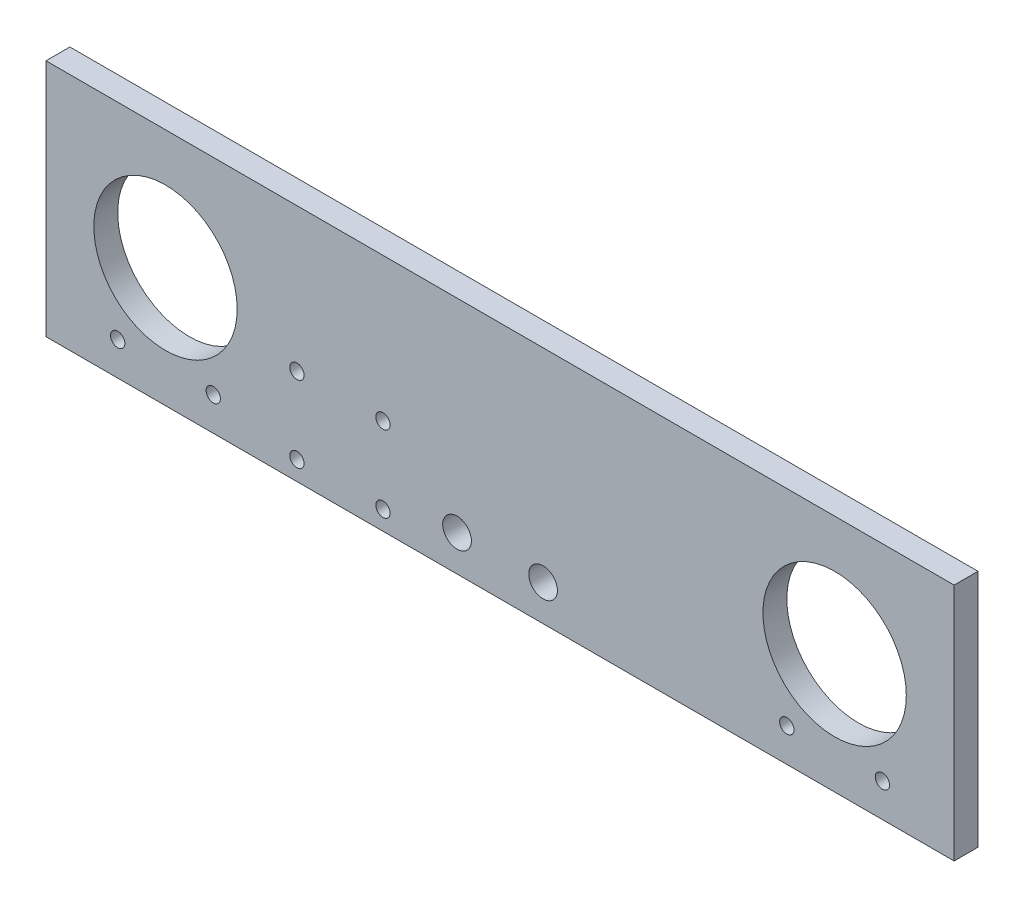
ISO-10303-21;
HEADER;
FILE_DESCRIPTION(('STEP AP214'),'2;1');
FILE_NAME('part.step','',(''),(''),'','','');
FILE_SCHEMA(('AUTOMOTIVE_DESIGN { 1 0 10303 214 1 1 1 1 }'));
ENDSEC;
DATA;
#1=APPLICATION_CONTEXT('core data for automotive mechanical design processes');
#2=APPLICATION_PROTOCOL_DEFINITION('international standard','automotive_design',2000,#1);
#3=PRODUCT_CONTEXT('',#1,'mechanical');
#4=PRODUCT('Part','Part','',(#3));
#5=PRODUCT_RELATED_PRODUCT_CATEGORY('part','',(#4));
#6=PRODUCT_DEFINITION_FORMATION('','',#4);
#7=PRODUCT_DEFINITION_CONTEXT('part definition',#1,'design');
#8=PRODUCT_DEFINITION('design','',#6,#7);
#9=PRODUCT_DEFINITION_SHAPE('','',#8);
#10=(LENGTH_UNIT() NAMED_UNIT(*) SI_UNIT(.MILLI.,.METRE.));
#11=(NAMED_UNIT(*) PLANE_ANGLE_UNIT() SI_UNIT($,.RADIAN.));
#12=(NAMED_UNIT(*) SI_UNIT($,.STERADIAN.) SOLID_ANGLE_UNIT());
#13=UNCERTAINTY_MEASURE_WITH_UNIT(LENGTH_MEASURE(1.E-05),#10,'distance_accuracy_value','');
#14=(GEOMETRIC_REPRESENTATION_CONTEXT(3) GLOBAL_UNCERTAINTY_ASSIGNED_CONTEXT((#13)) GLOBAL_UNIT_ASSIGNED_CONTEXT((#10,
#11,#12)) REPRESENTATION_CONTEXT('',''));
#15=CARTESIAN_POINT('',(0.,0.,0.));
#16=DIRECTION('',(0.,0.,1.));
#17=DIRECTION('',(1.,0.,0.));
#18=AXIS2_PLACEMENT_3D('',#15,#16,#17);
#19=CARTESIAN_POINT('',(0.,0.,0.));
#20=DIRECTION('',(0.,0.,1.));
#21=DIRECTION('',(1.,0.,0.));
#22=AXIS2_PLACEMENT_3D('',#19,#20,#21);
#23=PLANE('',#22);
#24=CARTESIAN_POINT('',(155.,7.,0.));
#25=DIRECTION('',(0.,0.,1.));
#26=DIRECTION('',(1.,0.,0.));
#27=AXIS2_PLACEMENT_3D('',#24,#25,#26);
#28=CIRCLE('',#27,2.75000000000001);
#29=CARTESIAN_POINT('',(157.75,7.,0.));
#30=VERTEX_POINT('',#29);
#31=EDGE_CURVE('E154',#30,#30,#28,.T.);
#32=ORIENTED_EDGE('',*,*,#31,.T.);
#33=EDGE_LOOP('',(#32));
#34=FACE_BOUND('',#33,.T.);
#35=CARTESIAN_POINT('',(15.,7.,0.));
#36=DIRECTION('',(0.,0.,1.));
#37=DIRECTION('',(1.,0.,0.));
#38=AXIS2_PLACEMENT_3D('',#35,#36,#37);
#39=CIRCLE('',#38,2.75);
#40=CARTESIAN_POINT('',(17.75,7.,0.));
#41=VERTEX_POINT('',#40);
#42=EDGE_CURVE('E143',#41,#41,#39,.T.);
#43=ORIENTED_EDGE('',*,*,#42,.T.);
#44=EDGE_LOOP('',(#43));
#45=FACE_BOUND('',#44,.T.);
#46=CARTESIAN_POINT('',(70.5,4.,0.));
#47=DIRECTION('',(0.,0.,1.));
#48=DIRECTION('',(1.,0.,0.));
#49=AXIS2_PLACEMENT_3D('',#46,#47,#48);
#50=CIRCLE('',#49,1.5);
#51=CARTESIAN_POINT('',(72.,4.,0.));
#52=VERTEX_POINT('',#51);
#53=EDGE_CURVE('E102',#52,#52,#50,.T.);
#54=ORIENTED_EDGE('',*,*,#53,.T.);
#55=EDGE_LOOP('',(#54));
#56=FACE_BOUND('',#55,.T.);
#57=CARTESIAN_POINT('',(52.5,20.,0.));
#58=DIRECTION('',(0.,0.,1.));
#59=DIRECTION('',(1.,0.,0.));
#60=AXIS2_PLACEMENT_3D('',#57,#58,#59);
#61=CIRCLE('',#60,1.5);
#62=CARTESIAN_POINT('',(54.,20.,0.));
#63=VERTEX_POINT('',#62);
#64=EDGE_CURVE('E105',#63,#63,#61,.T.);
#65=ORIENTED_EDGE('',*,*,#64,.T.);
#66=EDGE_LOOP('',(#65));
#67=FACE_BOUND('',#66,.T.);
#68=CARTESIAN_POINT('',(52.5,4.,0.));
#69=DIRECTION('',(0.,0.,1.));
#70=DIRECTION('',(1.,0.,0.));
#71=AXIS2_PLACEMENT_3D('',#68,#69,#70);
#72=CIRCLE('',#71,1.5);
#73=CARTESIAN_POINT('',(54.,4.,0.));
#74=VERTEX_POINT('',#73);
#75=EDGE_CURVE('E109',#74,#74,#72,.T.);
#76=ORIENTED_EDGE('',*,*,#75,.T.);
#77=EDGE_LOOP('',(#76));
#78=FACE_BOUND('',#77,.T.);
#79=CARTESIAN_POINT('',(104.,7.5,0.));
#80=DIRECTION('',(0.,0.,1.));
#81=DIRECTION('',(1.,0.,0.));
#82=AXIS2_PLACEMENT_3D('',#79,#80,#81);
#83=CIRCLE('',#82,3.00000000000001);
#84=CARTESIAN_POINT('',(107.,7.5,0.));
#85=VERTEX_POINT('',#84);
#86=EDGE_CURVE('E112',#85,#85,#83,.T.);
#87=ORIENTED_EDGE('',*,*,#86,.T.);
#88=EDGE_LOOP('',(#87));
#89=FACE_BOUND('',#88,.T.);
#90=CARTESIAN_POINT('',(86.,7.5,0.));
#91=DIRECTION('',(0.,0.,1.));
#92=DIRECTION('',(1.,0.,0.));
#93=AXIS2_PLACEMENT_3D('',#90,#91,#92);
#94=CIRCLE('',#93,3.00000000000001);
#95=CARTESIAN_POINT('',(89.,7.5,0.));
#96=VERTEX_POINT('',#95);
#97=EDGE_CURVE('E115',#96,#96,#94,.T.);
#98=ORIENTED_EDGE('',*,*,#97,.T.);
#99=EDGE_LOOP('',(#98));
#100=FACE_BOUND('',#99,.T.);
#101=CARTESIAN_POINT('',(70.5,20.,0.));
#102=DIRECTION('',(0.,0.,1.));
#103=DIRECTION('',(1.,0.,0.));
#104=AXIS2_PLACEMENT_3D('',#101,#102,#103);
#105=CIRCLE('',#104,1.5);
#106=CARTESIAN_POINT('',(72.,20.,0.));
#107=VERTEX_POINT('',#106);
#108=EDGE_CURVE('E118',#107,#107,#105,.T.);
#109=ORIENTED_EDGE('',*,*,#108,.T.);
#110=EDGE_LOOP('',(#109));
#111=FACE_BOUND('',#110,.T.);
#112=CARTESIAN_POINT('',(165.,25.,0.));
#113=DIRECTION('',(0.,0.,1.));
#114=DIRECTION('',(1.,0.,0.));
#115=AXIS2_PLACEMENT_3D('',#112,#113,#114);
#116=CIRCLE('',#115,15.);
#117=CARTESIAN_POINT('',(180.,25.,0.));
#118=VERTEX_POINT('',#117);
#119=EDGE_CURVE('E121',#118,#118,#116,.T.);
#120=ORIENTED_EDGE('',*,*,#119,.T.);
#121=EDGE_LOOP('',(#120));
#122=FACE_BOUND('',#121,.T.);
#123=CARTESIAN_POINT('',(25.,25.,0.));
#124=DIRECTION('',(0.,0.,1.));
#125=DIRECTION('',(1.,0.,0.));
#126=AXIS2_PLACEMENT_3D('',#123,#124,#125);
#127=CIRCLE('',#126,15.);
#128=CARTESIAN_POINT('',(40.,25.,0.));
#129=VERTEX_POINT('',#128);
#130=EDGE_CURVE('E124',#129,#129,#127,.T.);
#131=ORIENTED_EDGE('',*,*,#130,.T.);
#132=EDGE_LOOP('',(#131));
#133=FACE_BOUND('',#132,.T.);
#134=DIRECTION('',(1.,0.,0.));
#135=VECTOR('',#134,1.);
#136=CARTESIAN_POINT('',(0.,0.,0.));
#137=LINE('',#136,#135);
#138=CARTESIAN_POINT('',(0.,0.,0.));
#139=VERTEX_POINT('',#138);
#140=CARTESIAN_POINT('',(190.,0.,0.));
#141=VERTEX_POINT('',#140);
#142=EDGE_CURVE('E127',#139,#141,#137,.T.);
#143=ORIENTED_EDGE('',*,*,#142,.F.);
#144=DIRECTION('',(0.,1.,0.));
#145=VECTOR('',#144,1.);
#146=CARTESIAN_POINT('',(0.,0.,0.));
#147=LINE('',#146,#145);
#148=CARTESIAN_POINT('',(0.,50.,0.));
#149=VERTEX_POINT('',#148);
#150=EDGE_CURVE('E132',#139,#149,#147,.T.);
#151=ORIENTED_EDGE('',*,*,#150,.T.);
#152=DIRECTION('',(1.,0.,0.));
#153=VECTOR('',#152,1.);
#154=CARTESIAN_POINT('',(0.,50.,0.));
#155=LINE('',#154,#153);
#156=CARTESIAN_POINT('',(190.,50.,0.));
#157=VERTEX_POINT('',#156);
#158=EDGE_CURVE('E130',#149,#157,#155,.T.);
#159=ORIENTED_EDGE('',*,*,#158,.T.);
#160=DIRECTION('',(0.,1.,0.));
#161=VECTOR('',#160,1.);
#162=CARTESIAN_POINT('',(190.,0.,0.));
#163=LINE('',#162,#161);
#164=EDGE_CURVE('E92',#141,#157,#163,.T.);
#165=ORIENTED_EDGE('',*,*,#164,.F.);
#166=EDGE_LOOP('',(#143,#151,#159,#165));
#167=FACE_BOUND('',#166,.T.);
#168=CARTESIAN_POINT('',(35.,7.,0.));
#169=DIRECTION('',(0.,0.,1.));
#170=DIRECTION('',(1.,0.,0.));
#171=AXIS2_PLACEMENT_3D('',#168,#169,#170);
#172=CIRCLE('',#171,2.75);
#173=CARTESIAN_POINT('',(37.75,7.,0.));
#174=VERTEX_POINT('',#173);
#175=EDGE_CURVE('E147',#174,#174,#172,.T.);
#176=ORIENTED_EDGE('',*,*,#175,.T.);
#177=EDGE_LOOP('',(#176));
#178=FACE_BOUND('',#177,.T.);
#179=CARTESIAN_POINT('',(175.,7.,0.));
#180=DIRECTION('',(0.,0.,1.));
#181=DIRECTION('',(1.,0.,0.));
#182=AXIS2_PLACEMENT_3D('',#179,#180,#181);
#183=CIRCLE('',#182,2.75000000000001);
#184=CARTESIAN_POINT('',(177.75,7.,0.));
#185=VERTEX_POINT('',#184);
#186=EDGE_CURVE('E161',#185,#185,#183,.T.);
#187=ORIENTED_EDGE('',*,*,#186,.T.);
#188=EDGE_LOOP('',(#187));
#189=FACE_BOUND('',#188,.T.);
#190=ADVANCED_FACE('F35',(#34,#45,#56,#67,#78,#89,#100,#111,#122,#133,#167,#178,#189),#23,.F.);
#191=CARTESIAN_POINT('',(0.,0.,5.));
#192=DIRECTION('',(0.,1.,0.));
#193=DIRECTION('',(0.,0.,1.));
#194=AXIS2_PLACEMENT_3D('',#191,#192,#193);
#195=PLANE('',#194);
#196=ORIENTED_EDGE('',*,*,#142,.T.);
#197=DIRECTION('',(0.,0.,-1.));
#198=VECTOR('',#197,1.);
#199=CARTESIAN_POINT('',(190.,0.,5.));
#200=LINE('',#199,#198);
#201=CARTESIAN_POINT('',(190.,0.,5.));
#202=VERTEX_POINT('',#201);
#203=EDGE_CURVE('E11',#202,#141,#200,.T.);
#204=ORIENTED_EDGE('',*,*,#203,.F.);
#205=DIRECTION('',(1.,0.,0.));
#206=VECTOR('',#205,1.);
#207=CARTESIAN_POINT('',(0.,0.,5.));
#208=LINE('',#207,#206);
#209=CARTESIAN_POINT('',(0.,0.,5.));
#210=VERTEX_POINT('',#209);
#211=EDGE_CURVE('E87',#210,#202,#208,.T.);
#212=ORIENTED_EDGE('',*,*,#211,.F.);
#213=DIRECTION('',(0.,0.,-1.));
#214=VECTOR('',#213,1.);
#215=CARTESIAN_POINT('',(0.,0.,5.));
#216=LINE('',#215,#214);
#217=EDGE_CURVE('E54',#210,#139,#216,.T.);
#218=ORIENTED_EDGE('',*,*,#217,.T.);
#219=EDGE_LOOP('',(#196,#204,#212,#218));
#220=FACE_BOUND('',#219,.T.);
#221=ADVANCED_FACE('F226',(#220),#195,.F.);
#222=CARTESIAN_POINT('',(190.,0.,5.));
#223=DIRECTION('',(-1.,0.,0.));
#224=DIRECTION('',(0.,0.,1.));
#225=AXIS2_PLACEMENT_3D('',#222,#223,#224);
#226=PLANE('',#225);
#227=ORIENTED_EDGE('',*,*,#164,.T.);
#228=DIRECTION('',(0.,0.,-1.));
#229=VECTOR('',#228,1.);
#230=CARTESIAN_POINT('',(190.,50.,5.));
#231=LINE('',#230,#229);
#232=CARTESIAN_POINT('',(190.,50.,5.));
#233=VERTEX_POINT('',#232);
#234=EDGE_CURVE('E45',#233,#157,#231,.T.);
#235=ORIENTED_EDGE('',*,*,#234,.F.);
#236=DIRECTION('',(0.,1.,0.));
#237=VECTOR('',#236,1.);
#238=CARTESIAN_POINT('',(190.,0.,5.));
#239=LINE('',#238,#237);
#240=EDGE_CURVE('E79',#202,#233,#239,.T.);
#241=ORIENTED_EDGE('',*,*,#240,.F.);
#242=ORIENTED_EDGE('',*,*,#203,.T.);
#243=EDGE_LOOP('',(#227,#235,#241,#242));
#244=FACE_BOUND('',#243,.T.);
#245=ADVANCED_FACE('F91',(#244),#226,.F.);
#246=CARTESIAN_POINT('',(0.,50.,5.));
#247=DIRECTION('',(0.,1.,0.));
#248=DIRECTION('',(-1.,0.,0.));
#249=AXIS2_PLACEMENT_3D('',#246,#247,#248);
#250=PLANE('',#249);
#251=ORIENTED_EDGE('',*,*,#158,.F.);
#252=DIRECTION('',(0.,0.,-1.));
#253=VECTOR('',#252,1.);
#254=CARTESIAN_POINT('',(0.,50.,5.));
#255=LINE('',#254,#253);
#256=CARTESIAN_POINT('',(0.,50.,5.));
#257=VERTEX_POINT('',#256);
#258=EDGE_CURVE('E68',#257,#149,#255,.T.);
#259=ORIENTED_EDGE('',*,*,#258,.F.);
#260=DIRECTION('',(1.,0.,0.));
#261=VECTOR('',#260,1.);
#262=CARTESIAN_POINT('',(0.,50.,5.));
#263=LINE('',#262,#261);
#264=EDGE_CURVE('E86',#257,#233,#263,.T.);
#265=ORIENTED_EDGE('',*,*,#264,.T.);
#266=ORIENTED_EDGE('',*,*,#234,.T.);
#267=EDGE_LOOP('',(#251,#259,#265,#266));
#268=FACE_BOUND('',#267,.T.);
#269=ADVANCED_FACE('F96',(#268),#250,.T.);
#270=CARTESIAN_POINT('',(25.,25.,5.));
#271=DIRECTION('',(0.,0.,-1.));
#272=DIRECTION('',(-1.,0.,0.));
#273=AXIS2_PLACEMENT_3D('',#270,#271,#272);
#274=CYLINDRICAL_SURFACE('',#273,15.);
#275=CARTESIAN_POINT('',(25.,25.,5.));
#276=DIRECTION('',(0.,0.,1.));
#277=DIRECTION('',(1.,0.,0.));
#278=AXIS2_PLACEMENT_3D('',#275,#276,#277);
#279=CIRCLE('',#278,15.);
#280=CARTESIAN_POINT('',(40.,25.,5.));
#281=VERTEX_POINT('',#280);
#282=EDGE_CURVE('E202',#281,#281,#279,.T.);
#283=ORIENTED_EDGE('',*,*,#282,.T.);
#284=EDGE_LOOP('',(#283));
#285=FACE_BOUND('',#284,.T.);
#286=ORIENTED_EDGE('',*,*,#130,.F.);
#287=EDGE_LOOP('',(#286));
#288=FACE_BOUND('',#287,.T.);
#289=ADVANCED_FACE('F206',(#285,#288),#274,.F.);
#290=CARTESIAN_POINT('',(165.,25.,5.));
#291=DIRECTION('',(0.,0.,-1.));
#292=DIRECTION('',(-1.,0.,0.));
#293=AXIS2_PLACEMENT_3D('',#290,#291,#292);
#294=CYLINDRICAL_SURFACE('',#293,15.);
#295=CARTESIAN_POINT('',(165.,25.,5.));
#296=DIRECTION('',(0.,0.,1.));
#297=DIRECTION('',(1.,0.,0.));
#298=AXIS2_PLACEMENT_3D('',#295,#296,#297);
#299=CIRCLE('',#298,15.);
#300=CARTESIAN_POINT('',(180.,25.,5.));
#301=VERTEX_POINT('',#300);
#302=EDGE_CURVE('E199',#301,#301,#299,.T.);
#303=ORIENTED_EDGE('',*,*,#302,.T.);
#304=EDGE_LOOP('',(#303));
#305=FACE_BOUND('',#304,.T.);
#306=ORIENTED_EDGE('',*,*,#119,.F.);
#307=EDGE_LOOP('',(#306));
#308=FACE_BOUND('',#307,.T.);
#309=ADVANCED_FACE('F240',(#305,#308),#294,.F.);
#310=CARTESIAN_POINT('',(35.,7.,5.));
#311=DIRECTION('',(0.,0.,-1.));
#312=DIRECTION('',(-1.,0.,0.));
#313=AXIS2_PLACEMENT_3D('',#310,#311,#312);
#314=CYLINDRICAL_SURFACE('',#313,1.5);
#315=CARTESIAN_POINT('',(35.,7.,1.5));
#316=DIRECTION('',(0.,0.,1.));
#317=DIRECTION('',(1.,0.,0.));
#318=AXIS2_PLACEMENT_3D('',#315,#316,#317);
#319=CIRCLE('',#318,1.5);
#320=CARTESIAN_POINT('',(36.5,7.,1.5));
#321=VERTEX_POINT('',#320);
#322=EDGE_CURVE('E141',#321,#321,#319,.T.);
#323=ORIENTED_EDGE('',*,*,#322,.F.);
#324=EDGE_LOOP('',(#323));
#325=FACE_BOUND('',#324,.T.);
#326=CARTESIAN_POINT('',(35.,7.,5.));
#327=DIRECTION('',(0.,0.,1.));
#328=DIRECTION('',(1.,0.,0.));
#329=AXIS2_PLACEMENT_3D('',#326,#327,#328);
#330=CIRCLE('',#329,1.5);
#331=CARTESIAN_POINT('',(36.5,7.,5.));
#332=VERTEX_POINT('',#331);
#333=EDGE_CURVE('E196',#332,#332,#330,.T.);
#334=ORIENTED_EDGE('',*,*,#333,.T.);
#335=EDGE_LOOP('',(#334));
#336=FACE_BOUND('',#335,.T.);
#337=ADVANCED_FACE('F243',(#325,#336),#314,.F.);
#338=CARTESIAN_POINT('',(175.,7.,5.));
#339=DIRECTION('',(0.,0.,-1.));
#340=DIRECTION('',(-1.,0.,0.));
#341=AXIS2_PLACEMENT_3D('',#338,#339,#340);
#342=CYLINDRICAL_SURFACE('',#341,1.5);
#343=CARTESIAN_POINT('',(175.,7.,1.5));
#344=DIRECTION('',(0.,0.,1.));
#345=DIRECTION('',(1.,0.,0.));
#346=AXIS2_PLACEMENT_3D('',#343,#344,#345);
#347=CIRCLE('',#346,1.5);
#348=CARTESIAN_POINT('',(176.5,7.,1.5));
#349=VERTEX_POINT('',#348);
#350=EDGE_CURVE('E39',#349,#349,#347,.T.);
#351=ORIENTED_EDGE('',*,*,#350,.F.);
#352=EDGE_LOOP('',(#351));
#353=FACE_BOUND('',#352,.T.);
#354=CARTESIAN_POINT('',(175.,7.,5.));
#355=DIRECTION('',(0.,0.,1.));
#356=DIRECTION('',(1.,0.,0.));
#357=AXIS2_PLACEMENT_3D('',#354,#355,#356);
#358=CIRCLE('',#357,1.5);
#359=CARTESIAN_POINT('',(176.5,7.,5.));
#360=VERTEX_POINT('',#359);
#361=EDGE_CURVE('E193',#360,#360,#358,.T.);
#362=ORIENTED_EDGE('',*,*,#361,.T.);
#363=EDGE_LOOP('',(#362));
#364=FACE_BOUND('',#363,.T.);
#365=ADVANCED_FACE('F247',(#353,#364),#342,.F.);
#366=CARTESIAN_POINT('',(155.,7.,5.));
#367=DIRECTION('',(0.,0.,-1.));
#368=DIRECTION('',(-1.,0.,0.));
#369=AXIS2_PLACEMENT_3D('',#366,#367,#368);
#370=CYLINDRICAL_SURFACE('',#369,1.5);
#371=CARTESIAN_POINT('',(155.,7.,1.5));
#372=DIRECTION('',(0.,0.,1.));
#373=DIRECTION('',(1.,0.,0.));
#374=AXIS2_PLACEMENT_3D('',#371,#372,#373);
#375=CIRCLE('',#374,1.5);
#376=CARTESIAN_POINT('',(156.5,7.,1.5));
#377=VERTEX_POINT('',#376);
#378=EDGE_CURVE('E145',#377,#377,#375,.T.);
#379=ORIENTED_EDGE('',*,*,#378,.F.);
#380=EDGE_LOOP('',(#379));
#381=FACE_BOUND('',#380,.T.);
#382=CARTESIAN_POINT('',(155.,7.,5.));
#383=DIRECTION('',(0.,0.,1.));
#384=DIRECTION('',(1.,0.,0.));
#385=AXIS2_PLACEMENT_3D('',#382,#383,#384);
#386=CIRCLE('',#385,1.5);
#387=CARTESIAN_POINT('',(156.5,7.,5.));
#388=VERTEX_POINT('',#387);
#389=EDGE_CURVE('E190',#388,#388,#386,.T.);
#390=ORIENTED_EDGE('',*,*,#389,.T.);
#391=EDGE_LOOP('',(#390));
#392=FACE_BOUND('',#391,.T.);
#393=ADVANCED_FACE('F251',(#381,#392),#370,.F.);
#394=CARTESIAN_POINT('',(70.5,20.,5.));
#395=DIRECTION('',(0.,0.,-1.));
#396=DIRECTION('',(-1.,0.,0.));
#397=AXIS2_PLACEMENT_3D('',#394,#395,#396);
#398=CYLINDRICAL_SURFACE('',#397,1.5);
#399=CARTESIAN_POINT('',(70.5,20.,5.));
#400=DIRECTION('',(0.,0.,1.));
#401=DIRECTION('',(1.,0.,0.));
#402=AXIS2_PLACEMENT_3D('',#399,#400,#401);
#403=CIRCLE('',#402,1.5);
#404=CARTESIAN_POINT('',(72.,20.,5.));
#405=VERTEX_POINT('',#404);
#406=EDGE_CURVE('E187',#405,#405,#403,.T.);
#407=ORIENTED_EDGE('',*,*,#406,.T.);
#408=EDGE_LOOP('',(#407));
#409=FACE_BOUND('',#408,.T.);
#410=ORIENTED_EDGE('',*,*,#108,.F.);
#411=EDGE_LOOP('',(#410));
#412=FACE_BOUND('',#411,.T.);
#413=ADVANCED_FACE('F255',(#409,#412),#398,.F.);
#414=CARTESIAN_POINT('',(86.,7.5,5.));
#415=DIRECTION('',(0.,0.,-1.));
#416=DIRECTION('',(-1.,0.,0.));
#417=AXIS2_PLACEMENT_3D('',#414,#415,#416);
#418=CYLINDRICAL_SURFACE('',#417,3.00000000000001);
#419=CARTESIAN_POINT('',(86.,7.5,5.));
#420=DIRECTION('',(0.,0.,1.));
#421=DIRECTION('',(1.,0.,0.));
#422=AXIS2_PLACEMENT_3D('',#419,#420,#421);
#423=CIRCLE('',#422,3.00000000000001);
#424=CARTESIAN_POINT('',(89.,7.5,5.));
#425=VERTEX_POINT('',#424);
#426=EDGE_CURVE('E184',#425,#425,#423,.T.);
#427=ORIENTED_EDGE('',*,*,#426,.T.);
#428=EDGE_LOOP('',(#427));
#429=FACE_BOUND('',#428,.T.);
#430=ORIENTED_EDGE('',*,*,#97,.F.);
#431=EDGE_LOOP('',(#430));
#432=FACE_BOUND('',#431,.T.);
#433=ADVANCED_FACE('F259',(#429,#432),#418,.F.);
#434=CARTESIAN_POINT('',(104.,7.5,5.));
#435=DIRECTION('',(0.,0.,-1.));
#436=DIRECTION('',(-1.,0.,0.));
#437=AXIS2_PLACEMENT_3D('',#434,#435,#436);
#438=CYLINDRICAL_SURFACE('',#437,3.00000000000001);
#439=CARTESIAN_POINT('',(104.,7.5,5.));
#440=DIRECTION('',(0.,0.,1.));
#441=DIRECTION('',(1.,0.,0.));
#442=AXIS2_PLACEMENT_3D('',#439,#440,#441);
#443=CIRCLE('',#442,3.00000000000001);
#444=CARTESIAN_POINT('',(107.,7.5,5.));
#445=VERTEX_POINT('',#444);
#446=EDGE_CURVE('E181',#445,#445,#443,.T.);
#447=ORIENTED_EDGE('',*,*,#446,.T.);
#448=EDGE_LOOP('',(#447));
#449=FACE_BOUND('',#448,.T.);
#450=ORIENTED_EDGE('',*,*,#86,.F.);
#451=EDGE_LOOP('',(#450));
#452=FACE_BOUND('',#451,.T.);
#453=ADVANCED_FACE('F263',(#449,#452),#438,.F.);
#454=CARTESIAN_POINT('',(15.,7.,5.));
#455=DIRECTION('',(0.,0.,-1.));
#456=DIRECTION('',(-1.,0.,0.));
#457=AXIS2_PLACEMENT_3D('',#454,#455,#456);
#458=CYLINDRICAL_SURFACE('',#457,1.5);
#459=CARTESIAN_POINT('',(15.,7.,1.5));
#460=DIRECTION('',(0.,0.,1.));
#461=DIRECTION('',(1.,0.,0.));
#462=AXIS2_PLACEMENT_3D('',#459,#460,#461);
#463=CIRCLE('',#462,1.5);
#464=CARTESIAN_POINT('',(16.5,7.,1.5));
#465=VERTEX_POINT('',#464);
#466=EDGE_CURVE('E106',#465,#465,#463,.T.);
#467=ORIENTED_EDGE('',*,*,#466,.F.);
#468=EDGE_LOOP('',(#467));
#469=FACE_BOUND('',#468,.T.);
#470=CARTESIAN_POINT('',(15.,7.,5.));
#471=DIRECTION('',(0.,0.,1.));
#472=DIRECTION('',(1.,0.,0.));
#473=AXIS2_PLACEMENT_3D('',#470,#471,#472);
#474=CIRCLE('',#473,1.5);
#475=CARTESIAN_POINT('',(16.5,7.,5.));
#476=VERTEX_POINT('',#475);
#477=EDGE_CURVE('E178',#476,#476,#474,.T.);
#478=ORIENTED_EDGE('',*,*,#477,.T.);
#479=EDGE_LOOP('',(#478));
#480=FACE_BOUND('',#479,.T.);
#481=ADVANCED_FACE('F267',(#469,#480),#458,.F.);
#482=CARTESIAN_POINT('',(52.5,4.,5.));
#483=DIRECTION('',(0.,0.,-1.));
#484=DIRECTION('',(-1.,0.,0.));
#485=AXIS2_PLACEMENT_3D('',#482,#483,#484);
#486=CYLINDRICAL_SURFACE('',#485,1.5);
#487=CARTESIAN_POINT('',(52.5,4.,5.));
#488=DIRECTION('',(0.,0.,1.));
#489=DIRECTION('',(1.,0.,0.));
#490=AXIS2_PLACEMENT_3D('',#487,#488,#489);
#491=CIRCLE('',#490,1.5);
#492=CARTESIAN_POINT('',(54.,4.,5.));
#493=VERTEX_POINT('',#492);
#494=EDGE_CURVE('E175',#493,#493,#491,.T.);
#495=ORIENTED_EDGE('',*,*,#494,.T.);
#496=EDGE_LOOP('',(#495));
#497=FACE_BOUND('',#496,.T.);
#498=ORIENTED_EDGE('',*,*,#75,.F.);
#499=EDGE_LOOP('',(#498));
#500=FACE_BOUND('',#499,.T.);
#501=ADVANCED_FACE('F271',(#497,#500),#486,.F.);
#502=CARTESIAN_POINT('',(52.5,20.,5.));
#503=DIRECTION('',(0.,0.,-1.));
#504=DIRECTION('',(-1.,0.,0.));
#505=AXIS2_PLACEMENT_3D('',#502,#503,#504);
#506=CYLINDRICAL_SURFACE('',#505,1.5);
#507=CARTESIAN_POINT('',(52.5,20.,5.));
#508=DIRECTION('',(0.,0.,1.));
#509=DIRECTION('',(1.,0.,0.));
#510=AXIS2_PLACEMENT_3D('',#507,#508,#509);
#511=CIRCLE('',#510,1.5);
#512=CARTESIAN_POINT('',(54.,20.,5.));
#513=VERTEX_POINT('',#512);
#514=EDGE_CURVE('E172',#513,#513,#511,.T.);
#515=ORIENTED_EDGE('',*,*,#514,.T.);
#516=EDGE_LOOP('',(#515));
#517=FACE_BOUND('',#516,.T.);
#518=ORIENTED_EDGE('',*,*,#64,.F.);
#519=EDGE_LOOP('',(#518));
#520=FACE_BOUND('',#519,.T.);
#521=ADVANCED_FACE('F274',(#517,#520),#506,.F.);
#522=CARTESIAN_POINT('',(70.5,4.,5.));
#523=DIRECTION('',(0.,0.,-1.));
#524=DIRECTION('',(-1.,0.,0.));
#525=AXIS2_PLACEMENT_3D('',#522,#523,#524);
#526=CYLINDRICAL_SURFACE('',#525,1.5);
#527=CARTESIAN_POINT('',(70.5,4.,5.));
#528=DIRECTION('',(0.,0.,1.));
#529=DIRECTION('',(1.,0.,0.));
#530=AXIS2_PLACEMENT_3D('',#527,#528,#529);
#531=CIRCLE('',#530,1.5);
#532=CARTESIAN_POINT('',(72.,4.,5.));
#533=VERTEX_POINT('',#532);
#534=EDGE_CURVE('E135',#533,#533,#531,.T.);
#535=ORIENTED_EDGE('',*,*,#534,.T.);
#536=EDGE_LOOP('',(#535));
#537=FACE_BOUND('',#536,.T.);
#538=ORIENTED_EDGE('',*,*,#53,.F.);
#539=EDGE_LOOP('',(#538));
#540=FACE_BOUND('',#539,.T.);
#541=ADVANCED_FACE('F37',(#537,#540),#526,.F.);
#542=CARTESIAN_POINT('',(0.,0.,5.));
#543=DIRECTION('',(-1.,0.,0.));
#544=DIRECTION('',(0.,0.,1.));
#545=AXIS2_PLACEMENT_3D('',#542,#543,#544);
#546=PLANE('',#545);
#547=ORIENTED_EDGE('',*,*,#150,.F.);
#548=ORIENTED_EDGE('',*,*,#217,.F.);
#549=DIRECTION('',(0.,1.,0.));
#550=VECTOR('',#549,1.);
#551=CARTESIAN_POINT('',(0.,0.,5.));
#552=LINE('',#551,#550);
#553=EDGE_CURVE('E97',#210,#257,#552,.T.);
#554=ORIENTED_EDGE('',*,*,#553,.T.);
#555=ORIENTED_EDGE('',*,*,#258,.T.);
#556=EDGE_LOOP('',(#547,#548,#554,#555));
#557=FACE_BOUND('',#556,.T.);
#558=ADVANCED_FACE('F211',(#557),#546,.T.);
#559=CARTESIAN_POINT('',(0.,0.,5.));
#560=DIRECTION('',(0.,0.,1.));
#561=DIRECTION('',(1.,0.,0.));
#562=AXIS2_PLACEMENT_3D('',#559,#560,#561);
#563=PLANE('',#562);
#564=ORIENTED_EDGE('',*,*,#534,.F.);
#565=EDGE_LOOP('',(#564));
#566=FACE_BOUND('',#565,.T.);
#567=ORIENTED_EDGE('',*,*,#514,.F.);
#568=EDGE_LOOP('',(#567));
#569=FACE_BOUND('',#568,.T.);
#570=ORIENTED_EDGE('',*,*,#494,.F.);
#571=EDGE_LOOP('',(#570));
#572=FACE_BOUND('',#571,.T.);
#573=ORIENTED_EDGE('',*,*,#477,.F.);
#574=EDGE_LOOP('',(#573));
#575=FACE_BOUND('',#574,.T.);
#576=ORIENTED_EDGE('',*,*,#446,.F.);
#577=EDGE_LOOP('',(#576));
#578=FACE_BOUND('',#577,.T.);
#579=ORIENTED_EDGE('',*,*,#426,.F.);
#580=EDGE_LOOP('',(#579));
#581=FACE_BOUND('',#580,.T.);
#582=ORIENTED_EDGE('',*,*,#406,.F.);
#583=EDGE_LOOP('',(#582));
#584=FACE_BOUND('',#583,.T.);
#585=ORIENTED_EDGE('',*,*,#389,.F.);
#586=EDGE_LOOP('',(#585));
#587=FACE_BOUND('',#586,.T.);
#588=ORIENTED_EDGE('',*,*,#361,.F.);
#589=EDGE_LOOP('',(#588));
#590=FACE_BOUND('',#589,.T.);
#591=ORIENTED_EDGE('',*,*,#333,.F.);
#592=EDGE_LOOP('',(#591));
#593=FACE_BOUND('',#592,.T.);
#594=ORIENTED_EDGE('',*,*,#302,.F.);
#595=EDGE_LOOP('',(#594));
#596=FACE_BOUND('',#595,.T.);
#597=ORIENTED_EDGE('',*,*,#282,.F.);
#598=EDGE_LOOP('',(#597));
#599=FACE_BOUND('',#598,.T.);
#600=ORIENTED_EDGE('',*,*,#211,.T.);
#601=ORIENTED_EDGE('',*,*,#240,.T.);
#602=ORIENTED_EDGE('',*,*,#264,.F.);
#603=ORIENTED_EDGE('',*,*,#553,.F.);
#604=EDGE_LOOP('',(#600,#601,#602,#603));
#605=FACE_BOUND('',#604,.T.);
#606=ADVANCED_FACE('F83',(#566,#569,#572,#575,#578,#581,#584,#587,#590,#593,#596,#599,#605),
#563,.T.);
#607=CARTESIAN_POINT('',(15.,7.,1.5));
#608=DIRECTION('',(0.,0.,-1.));
#609=DIRECTION('',(-1.,0.,0.));
#610=AXIS2_PLACEMENT_3D('',#607,#608,#609);
#611=CYLINDRICAL_SURFACE('',#610,2.75);
#612=CARTESIAN_POINT('',(15.,7.,1.5));
#613=DIRECTION('',(0.,0.,1.));
#614=DIRECTION('',(1.,0.,0.));
#615=AXIS2_PLACEMENT_3D('',#612,#613,#614);
#616=CIRCLE('',#615,2.75);
#617=CARTESIAN_POINT('',(17.75,7.,1.5));
#618=VERTEX_POINT('',#617);
#619=EDGE_CURVE('E140',#618,#618,#616,.T.);
#620=ORIENTED_EDGE('',*,*,#619,.T.);
#621=EDGE_LOOP('',(#620));
#622=FACE_BOUND('',#621,.T.);
#623=ORIENTED_EDGE('',*,*,#42,.F.);
#624=EDGE_LOOP('',(#623));
#625=FACE_BOUND('',#624,.T.);
#626=ADVANCED_FACE('F210',(#622,#625),#611,.F.);
#627=CARTESIAN_POINT('',(15.,7.,1.5));
#628=DIRECTION('',(0.,0.,1.));
#629=DIRECTION('',(1.,0.,0.));
#630=AXIS2_PLACEMENT_3D('',#627,#628,#629);
#631=PLANE('',#630);
#632=ORIENTED_EDGE('',*,*,#466,.T.);
#633=EDGE_LOOP('',(#632));
#634=FACE_BOUND('',#633,.T.);
#635=ORIENTED_EDGE('',*,*,#619,.F.);
#636=EDGE_LOOP('',(#635));
#637=FACE_BOUND('',#636,.T.);
#638=ADVANCED_FACE('F218',(#634,#637),#631,.F.);
#639=CARTESIAN_POINT('',(35.,7.,1.5));
#640=DIRECTION('',(0.,0.,-1.));
#641=DIRECTION('',(-1.,0.,0.));
#642=AXIS2_PLACEMENT_3D('',#639,#640,#641);
#643=CYLINDRICAL_SURFACE('',#642,2.75);
#644=CARTESIAN_POINT('',(35.,7.,1.5));
#645=DIRECTION('',(0.,0.,1.));
#646=DIRECTION('',(1.,0.,0.));
#647=AXIS2_PLACEMENT_3D('',#644,#645,#646);
#648=CIRCLE('',#647,2.75);
#649=CARTESIAN_POINT('',(37.75,7.,1.5));
#650=VERTEX_POINT('',#649);
#651=EDGE_CURVE('E144',#650,#650,#648,.T.);
#652=ORIENTED_EDGE('',*,*,#651,.T.);
#653=EDGE_LOOP('',(#652));
#654=FACE_BOUND('',#653,.T.);
#655=ORIENTED_EDGE('',*,*,#175,.F.);
#656=EDGE_LOOP('',(#655));
#657=FACE_BOUND('',#656,.T.);
#658=ADVANCED_FACE('F340',(#654,#657),#643,.F.);
#659=CARTESIAN_POINT('',(35.,7.,1.5));
#660=DIRECTION('',(0.,0.,1.));
#661=DIRECTION('',(1.,0.,0.));
#662=AXIS2_PLACEMENT_3D('',#659,#660,#661);
#663=PLANE('',#662);
#664=ORIENTED_EDGE('',*,*,#322,.T.);
#665=EDGE_LOOP('',(#664));
#666=FACE_BOUND('',#665,.T.);
#667=ORIENTED_EDGE('',*,*,#651,.F.);
#668=EDGE_LOOP('',(#667));
#669=FACE_BOUND('',#668,.T.);
#670=ADVANCED_FACE('F337',(#666,#669),#663,.F.);
#671=CARTESIAN_POINT('',(155.,7.,1.5));
#672=DIRECTION('',(0.,0.,-1.));
#673=DIRECTION('',(-1.,0.,0.));
#674=AXIS2_PLACEMENT_3D('',#671,#672,#673);
#675=CYLINDRICAL_SURFACE('',#674,2.75000000000001);
#676=CARTESIAN_POINT('',(155.,7.,1.5));
#677=DIRECTION('',(0.,0.,1.));
#678=DIRECTION('',(1.,0.,0.));
#679=AXIS2_PLACEMENT_3D('',#676,#677,#678);
#680=CIRCLE('',#679,2.75000000000001);
#681=CARTESIAN_POINT('',(157.75,7.,1.5));
#682=VERTEX_POINT('',#681);
#683=EDGE_CURVE('E148',#682,#682,#680,.T.);
#684=ORIENTED_EDGE('',*,*,#683,.T.);
#685=EDGE_LOOP('',(#684));
#686=FACE_BOUND('',#685,.T.);
#687=ORIENTED_EDGE('',*,*,#31,.F.);
#688=EDGE_LOOP('',(#687));
#689=FACE_BOUND('',#688,.T.);
#690=ADVANCED_FACE('F334',(#686,#689),#675,.F.);
#691=CARTESIAN_POINT('',(155.,7.,1.5));
#692=DIRECTION('',(0.,0.,1.));
#693=DIRECTION('',(1.,0.,0.));
#694=AXIS2_PLACEMENT_3D('',#691,#692,#693);
#695=PLANE('',#694);
#696=ORIENTED_EDGE('',*,*,#378,.T.);
#697=EDGE_LOOP('',(#696));
#698=FACE_BOUND('',#697,.T.);
#699=ORIENTED_EDGE('',*,*,#683,.F.);
#700=EDGE_LOOP('',(#699));
#701=FACE_BOUND('',#700,.T.);
#702=ADVANCED_FACE('F329',(#698,#701),#695,.F.);
#703=CARTESIAN_POINT('',(175.,7.,1.5));
#704=DIRECTION('',(0.,0.,-1.));
#705=DIRECTION('',(-1.,0.,0.));
#706=AXIS2_PLACEMENT_3D('',#703,#704,#705);
#707=CYLINDRICAL_SURFACE('',#706,2.75000000000001);
#708=CARTESIAN_POINT('',(175.,7.,1.5));
#709=DIRECTION('',(0.,0.,1.));
#710=DIRECTION('',(1.,0.,0.));
#711=AXIS2_PLACEMENT_3D('',#708,#709,#710);
#712=CIRCLE('',#711,2.75000000000001);
#713=CARTESIAN_POINT('',(177.75,7.,1.5));
#714=VERTEX_POINT('',#713);
#715=EDGE_CURVE('E305',#714,#714,#712,.T.);
#716=ORIENTED_EDGE('',*,*,#715,.T.);
#717=EDGE_LOOP('',(#716));
#718=FACE_BOUND('',#717,.T.);
#719=ORIENTED_EDGE('',*,*,#186,.F.);
#720=EDGE_LOOP('',(#719));
#721=FACE_BOUND('',#720,.T.);
#722=ADVANCED_FACE('F324',(#718,#721),#707,.F.);
#723=CARTESIAN_POINT('',(175.,7.,1.5));
#724=DIRECTION('',(0.,0.,1.));
#725=DIRECTION('',(1.,0.,0.));
#726=AXIS2_PLACEMENT_3D('',#723,#724,#725);
#727=PLANE('',#726);
#728=ORIENTED_EDGE('',*,*,#350,.T.);
#729=EDGE_LOOP('',(#728));
#730=FACE_BOUND('',#729,.T.);
#731=ORIENTED_EDGE('',*,*,#715,.F.);
#732=EDGE_LOOP('',(#731));
#733=FACE_BOUND('',#732,.T.);
#734=ADVANCED_FACE('F312',(#730,#733),#727,.F.);
#735=CLOSED_SHELL('',(#190,#221,#245,#269,#289,#309,#337,#365,#393,#413,#433,#453,#481,#501,
#521,#541,#558,#606,#626,#638,#658,#670,#690,#702,#722,#734));
#736=MANIFOLD_SOLID_BREP('B2',#735);
#737=ADVANCED_BREP_SHAPE_REPRESENTATION('',(#18,#736),#14);
#738=SHAPE_DEFINITION_REPRESENTATION(#9,#737);
ENDSEC;
END-ISO-10303-21;
